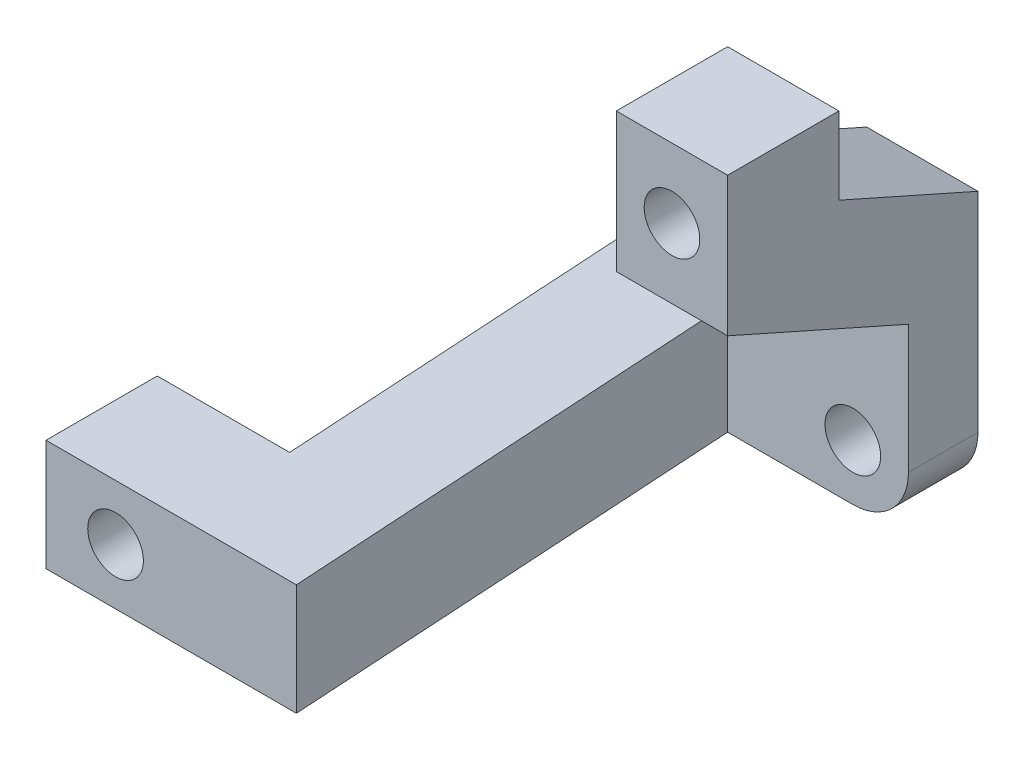
ISO-10303-21;
HEADER;
FILE_DESCRIPTION(('STEP AP214'),'2;1');
FILE_NAME('part.step','',(''),(''),'','','');
FILE_SCHEMA(('AUTOMOTIVE_DESIGN { 1 0 10303 214 1 1 1 1 }'));
ENDSEC;
DATA;
#1=APPLICATION_CONTEXT('core data for automotive mechanical design processes');
#2=APPLICATION_PROTOCOL_DEFINITION('international standard','automotive_design',2000,#1);
#3=PRODUCT_CONTEXT('',#1,'mechanical');
#4=PRODUCT('Part','Part','',(#3));
#5=PRODUCT_RELATED_PRODUCT_CATEGORY('part','',(#4));
#6=PRODUCT_DEFINITION_FORMATION('','',#4);
#7=PRODUCT_DEFINITION_CONTEXT('part definition',#1,'design');
#8=PRODUCT_DEFINITION('design','',#6,#7);
#9=PRODUCT_DEFINITION_SHAPE('','',#8);
#10=(LENGTH_UNIT() NAMED_UNIT(*) SI_UNIT(.MILLI.,.METRE.));
#11=(NAMED_UNIT(*) PLANE_ANGLE_UNIT() SI_UNIT($,.RADIAN.));
#12=(NAMED_UNIT(*) SI_UNIT($,.STERADIAN.) SOLID_ANGLE_UNIT());
#13=UNCERTAINTY_MEASURE_WITH_UNIT(LENGTH_MEASURE(1.E-05),#10,'distance_accuracy_value','');
#14=(GEOMETRIC_REPRESENTATION_CONTEXT(3) GLOBAL_UNCERTAINTY_ASSIGNED_CONTEXT((#13)) GLOBAL_UNIT_ASSIGNED_CONTEXT((#10,
#11,#12)) REPRESENTATION_CONTEXT('',''));
#15=CARTESIAN_POINT('',(0.,0.,0.));
#16=DIRECTION('',(0.,0.,1.));
#17=DIRECTION('',(1.,0.,0.));
#18=AXIS2_PLACEMENT_3D('',#15,#16,#17);
#19=CARTESIAN_POINT('',(0.,12.5257731958763,-5.56701030927835));
#20=DIRECTION('',(0.,-0.913811548620257,0.406138466053448));
#21=DIRECTION('',(0.,-0.406138466053448,-0.913811548620257));
#22=AXIS2_PLACEMENT_3D('',#19,#20,#21);
#23=PLANE('',#22);
#24=CARTESIAN_POINT('',(0.,20.,11.25));
#25=DIRECTION('',(0.,-0.913811548620257,0.406138466053448));
#26=DIRECTION('',(0.,-0.406138466053448,-0.913811548620257));
#27=AXIS2_PLACEMENT_3D('',#24,#25,#26);
#28=ELLIPSE('',#27,4.92442890089806,2.);
#29=CARTESIAN_POINT('',(1.92129071842118,19.4444444444444,10.));
#30=VERTEX_POINT('',#29);
#31=CARTESIAN_POINT('',(-1.92129071842118,19.4444444444444,10.));
#32=VERTEX_POINT('',#31);
#33=EDGE_CURVE('E72',#30,#32,#28,.F.);
#34=ORIENTED_EDGE('',*,*,#33,.F.);
#35=DIRECTION('',(-1.,0.,0.));
#36=VECTOR('',#35,1.);
#37=CARTESIAN_POINT('',(-4.,19.4444444444444,10.));
#38=LINE('',#37,#36);
#39=CARTESIAN_POINT('',(4.,19.4444444444444,10.));
#40=VERTEX_POINT('',#39);
#41=EDGE_CURVE('E78',#40,#30,#38,.T.);
#42=ORIENTED_EDGE('',*,*,#41,.F.);
#43=DIRECTION('',(0.,0.406138466053448,0.913811548620257));
#44=VECTOR('',#43,1.);
#45=CARTESIAN_POINT('',(4.,15.,0.));
#46=LINE('',#45,#44);
#47=CARTESIAN_POINT('',(4.,15.,0.));
#48=VERTEX_POINT('',#47);
#49=EDGE_CURVE('E232',#48,#40,#46,.T.);
#50=ORIENTED_EDGE('',*,*,#49,.F.);
#51=CARTESIAN_POINT('',(4.,15.,0.));
#52=DIRECTION('',(-1.,0.,0.));
#53=VECTOR('',#52,1.);
#54=LINE('',#51,#53);
#55=CARTESIAN_POINT('',(-4.,15.,0.));
#56=VERTEX_POINT('',#55);
#57=EDGE_CURVE('E227',#48,#56,#54,.T.);
#58=ORIENTED_EDGE('',*,*,#57,.T.);
#59=DIRECTION('',(0.,0.406138466053448,0.913811548620257));
#60=VECTOR('',#59,1.);
#61=CARTESIAN_POINT('',(-4.,15.,0.));
#62=LINE('',#61,#60);
#63=CARTESIAN_POINT('',(-4.,19.4444444444444,10.));
#64=VERTEX_POINT('',#63);
#65=EDGE_CURVE('E315',#56,#64,#62,.T.);
#66=ORIENTED_EDGE('',*,*,#65,.T.);
#67=EDGE_CURVE('E203',#32,#64,#38,.T.);
#68=ORIENTED_EDGE('',*,*,#67,.F.);
#69=EDGE_LOOP('',(#34,#42,#50,#58,#66,#68));
#70=FACE_BOUND('',#69,.T.);
#71=ADVANCED_FACE('F57',(#70),#23,.F.);
#72=CARTESIAN_POINT('',(0.,0.,5.));
#73=DIRECTION('',(0.,0.,1.));
#74=DIRECTION('',(1.,0.,0.));
#75=AXIS2_PLACEMENT_3D('',#72,#73,#74);
#76=PLANE('',#75);
#77=CARTESIAN_POINT('',(0.,0.,5.));
#78=DIRECTION('',(0.,0.,1.));
#79=DIRECTION('',(1.,0.,0.));
#80=AXIS2_PLACEMENT_3D('',#77,#78,#79);
#81=CIRCLE('',#80,2.);
#82=CARTESIAN_POINT('',(2.,0.,5.));
#83=VERTEX_POINT('',#82);
#84=EDGE_CURVE('E881',#83,#83,#81,.T.);
#85=ORIENTED_EDGE('',*,*,#84,.F.);
#86=EDGE_LOOP('',(#85));
#87=FACE_BOUND('',#86,.T.);
#88=DIRECTION('',(0.,-1.,0.));
#89=VECTOR('',#88,1.);
#90=CARTESIAN_POINT('',(4.,0.,5.));
#91=LINE('',#90,#89);
#92=CARTESIAN_POINT('',(4.,9.22222222222222,5.));
#93=VERTEX_POINT('',#92);
#94=CARTESIAN_POINT('',(4.,0.,5.));
#95=VERTEX_POINT('',#94);
#96=EDGE_CURVE('E460',#93,#95,#91,.T.);
#97=ORIENTED_EDGE('',*,*,#96,.F.);
#98=DIRECTION('',(-1.,0.,0.));
#99=VECTOR('',#98,1.);
#100=CARTESIAN_POINT('',(0.,9.22222222222222,5.));
#101=LINE('',#100,#99);
#102=CARTESIAN_POINT('',(-4.,9.22222222222222,5.));
#103=VERTEX_POINT('',#102);
#104=EDGE_CURVE('E276',#93,#103,#101,.T.);
#105=ORIENTED_EDGE('',*,*,#104,.T.);
#106=DIRECTION('',(0.,1.,0.));
#107=VECTOR('',#106,1.);
#108=CARTESIAN_POINT('',(-4.,0.,5.));
#109=LINE('',#108,#107);
#110=CARTESIAN_POINT('',(-4.,8.00000000000003,5.));
#111=VERTEX_POINT('',#110);
#112=EDGE_CURVE('E695',#111,#103,#109,.T.);
#113=ORIENTED_EDGE('',*,*,#112,.F.);
#114=CARTESIAN_POINT('',(-8.,8.,5.));
#115=DIRECTION('',(0.,0.,1.));
#116=DIRECTION('',(1.,0.,0.));
#117=AXIS2_PLACEMENT_3D('',#114,#115,#116);
#118=CIRCLE('',#117,4.);
#119=CARTESIAN_POINT('',(-8.00000000000003,4.,5.));
#120=VERTEX_POINT('',#119);
#121=EDGE_CURVE('E473',#111,#120,#118,.F.);
#122=ORIENTED_EDGE('',*,*,#121,.T.);
#123=DIRECTION('',(1.,0.,0.));
#124=VECTOR('',#123,1.);
#125=CARTESIAN_POINT('',(0.,4.,5.));
#126=LINE('',#125,#124);
#127=CARTESIAN_POINT('',(-9.00000000000001,4.,5.));
#128=VERTEX_POINT('',#127);
#129=EDGE_CURVE('E468',#128,#120,#126,.T.);
#130=ORIENTED_EDGE('',*,*,#129,.F.);
#131=DIRECTION('',(0.,1.,0.));
#132=VECTOR('',#131,1.);
#133=CARTESIAN_POINT('',(-9.00000000000001,4.,5.));
#134=LINE('',#133,#132);
#135=CARTESIAN_POINT('',(-9.00000000000001,-4.,5.));
#136=VERTEX_POINT('',#135);
#137=EDGE_CURVE('E494',#136,#128,#134,.T.);
#138=ORIENTED_EDGE('',*,*,#137,.F.);
#139=DIRECTION('',(1.,0.,0.));
#140=VECTOR('',#139,1.);
#141=CARTESIAN_POINT('',(0.,-4.,5.));
#142=LINE('',#141,#140);
#143=CARTESIAN_POINT('',(0.,-4.,5.));
#144=VERTEX_POINT('',#143);
#145=EDGE_CURVE('E474',#136,#144,#142,.T.);
#146=ORIENTED_EDGE('',*,*,#145,.T.);
#147=CARTESIAN_POINT('',(0.,0.,5.));
#148=DIRECTION('',(0.,0.,1.));
#149=DIRECTION('',(1.,0.,0.));
#150=AXIS2_PLACEMENT_3D('',#147,#148,#149);
#151=CIRCLE('',#150,4.);
#152=EDGE_CURVE('E620',#144,#95,#151,.T.);
#153=ORIENTED_EDGE('',*,*,#152,.T.);
#154=EDGE_LOOP('',(#97,#105,#113,#122,#130,#138,#146,#153));
#155=FACE_BOUND('',#154,.T.);
#156=ADVANCED_FACE('F243',(#87,#155),#76,.T.);
#157=CARTESIAN_POINT('',(-4.,0.,5.));
#158=DIRECTION('',(-1.,0.,0.));
#159=DIRECTION('',(0.,-1.,0.));
#160=AXIS2_PLACEMENT_3D('',#157,#158,#159);
#161=PLANE('',#160);
#162=DIRECTION('',(0.,1.,0.));
#163=VECTOR('',#162,1.);
#164=CARTESIAN_POINT('',(-4.,0.,0.));
#165=LINE('',#164,#163);
#166=CARTESIAN_POINT('',(-4.,8.00000000000003,0.));
#167=VERTEX_POINT('',#166);
#168=EDGE_CURVE('E428',#167,#56,#165,.T.);
#169=ORIENTED_EDGE('',*,*,#168,.F.);
#170=DIRECTION('',(0.,0.,-1.));
#171=VECTOR('',#170,1.);
#172=CARTESIAN_POINT('',(-4.,8.00000000000003,5.));
#173=LINE('',#172,#171);
#174=EDGE_CURVE('E66',#111,#167,#173,.T.);
#175=ORIENTED_EDGE('',*,*,#174,.F.);
#176=ORIENTED_EDGE('',*,*,#112,.T.);
#177=DIRECTION('',(0.,0.406138466053448,0.913811548620257));
#178=VECTOR('',#177,1.);
#179=CARTESIAN_POINT('',(-4.,7.,0.));
#180=LINE('',#179,#178);
#181=CARTESIAN_POINT('',(-4.,15.,18.));
#182=VERTEX_POINT('',#181);
#183=EDGE_CURVE('E307',#103,#182,#180,.T.);
#184=ORIENTED_EDGE('',*,*,#183,.T.);
#185=DIRECTION('',(0.,-1.,0.));
#186=VECTOR('',#185,1.);
#187=CARTESIAN_POINT('',(-4.,15.,18.));
#188=LINE('',#187,#186);
#189=CARTESIAN_POINT('',(-4.,23.,18.));
#190=VERTEX_POINT('',#189);
#191=EDGE_CURVE('E295',#190,#182,#188,.T.);
#192=ORIENTED_EDGE('',*,*,#191,.F.);
#193=DIRECTION('',(0.,1.,0.));
#194=VECTOR('',#193,1.);
#195=CARTESIAN_POINT('',(-4.,9.37497318287024,18.));
#196=LINE('',#195,#194);
#197=CARTESIAN_POINT('',(-4.,25.,18.));
#198=VERTEX_POINT('',#197);
#199=EDGE_CURVE('E216',#190,#198,#196,.T.);
#200=ORIENTED_EDGE('',*,*,#199,.T.);
#201=DIRECTION('',(0.,0.,1.));
#202=VECTOR('',#201,1.);
#203=CARTESIAN_POINT('',(-4.,25.,18.));
#204=LINE('',#203,#202);
#205=CARTESIAN_POINT('',(-4.,25.,10.));
#206=VERTEX_POINT('',#205);
#207=EDGE_CURVE('E219',#206,#198,#204,.T.);
#208=ORIENTED_EDGE('',*,*,#207,.F.);
#209=DIRECTION('',(0.,1.,0.));
#210=VECTOR('',#209,1.);
#211=CARTESIAN_POINT('',(-4.,9.37497318287024,10.));
#212=LINE('',#211,#210);
#213=EDGE_CURVE('E212',#64,#206,#212,.T.);
#214=ORIENTED_EDGE('',*,*,#213,.F.);
#215=ORIENTED_EDGE('',*,*,#65,.F.);
#216=EDGE_LOOP('',(#169,#175,#176,#184,#192,#200,#208,#214,#215));
#217=FACE_BOUND('',#216,.T.);
#218=ADVANCED_FACE('F402',(#217),#161,.T.);
#219=CARTESIAN_POINT('',(-8.,8.,5.));
#220=DIRECTION('',(0.,0.,-1.));
#221=DIRECTION('',(-1.,0.,0.));
#222=AXIS2_PLACEMENT_3D('',#219,#220,#221);
#223=CYLINDRICAL_SURFACE('',#222,4.);
#224=CARTESIAN_POINT('',(-8.,8.,0.));
#225=DIRECTION('',(0.,0.,1.));
#226=DIRECTION('',(1.,0.,0.));
#227=AXIS2_PLACEMENT_3D('',#224,#225,#226);
#228=CIRCLE('',#227,4.);
#229=CARTESIAN_POINT('',(-8.00000000000003,4.,0.));
#230=VERTEX_POINT('',#229);
#231=EDGE_CURVE('E431',#167,#230,#228,.F.);
#232=ORIENTED_EDGE('',*,*,#231,.T.);
#233=DIRECTION('',(0.,0.,-1.));
#234=VECTOR('',#233,1.);
#235=CARTESIAN_POINT('',(-8.00000000000003,4.,5.));
#236=LINE('',#235,#234);
#237=EDGE_CURVE('E443',#120,#230,#236,.T.);
#238=ORIENTED_EDGE('',*,*,#237,.F.);
#239=ORIENTED_EDGE('',*,*,#121,.F.);
#240=ORIENTED_EDGE('',*,*,#174,.T.);
#241=EDGE_LOOP('',(#232,#238,#239,#240));
#242=FACE_BOUND('',#241,.T.);
#243=ADVANCED_FACE('F400',(#242),#223,.F.);
#244=CARTESIAN_POINT('',(0.,4.,5.));
#245=DIRECTION('',(0.,1.,0.));
#246=DIRECTION('',(-1.,0.,0.));
#247=AXIS2_PLACEMENT_3D('',#244,#245,#246);
#248=PLANE('',#247);
#249=DIRECTION('',(1.,0.,0.));
#250=VECTOR('',#249,1.);
#251=CARTESIAN_POINT('',(0.,4.,0.));
#252=LINE('',#251,#250);
#253=CARTESIAN_POINT('',(-15.,4.,0.));
#254=VERTEX_POINT('',#253);
#255=EDGE_CURVE('E438',#254,#230,#252,.T.);
#256=ORIENTED_EDGE('',*,*,#255,.F.);
#257=DIRECTION('',(0.,0.,-1.));
#258=VECTOR('',#257,1.);
#259=CARTESIAN_POINT('',(-15.,4.,5.));
#260=LINE('',#259,#258);
#261=CARTESIAN_POINT('',(-15.,4.,5.));
#262=VERTEX_POINT('',#261);
#263=EDGE_CURVE('E467',#262,#254,#260,.T.);
#264=ORIENTED_EDGE('',*,*,#263,.F.);
#265=DIRECTION('',(-1.,0.,0.));
#266=VECTOR('',#265,1.);
#267=CARTESIAN_POINT('',(-17.,4.,5.));
#268=LINE('',#267,#266);
#269=CARTESIAN_POINT('',(-17.,4.,5.));
#270=VERTEX_POINT('',#269);
#271=EDGE_CURVE('E496',#262,#270,#268,.T.);
#272=ORIENTED_EDGE('',*,*,#271,.T.);
#273=DIRECTION('',(0.0604950604018905,0.,0.998168496631191));
#274=VECTOR('',#273,1.);
#275=CARTESIAN_POINT('',(-17.,4.,5.));
#276=LINE('',#275,#274);
#277=CARTESIAN_POINT('',(-15.4848484848485,4.,30.));
#278=VERTEX_POINT('',#277);
#279=EDGE_CURVE('E586',#270,#278,#276,.T.);
#280=ORIENTED_EDGE('',*,*,#279,.T.);
#281=DIRECTION('',(-1.,0.,0.));
#282=VECTOR('',#281,1.);
#283=CARTESIAN_POINT('',(-3.91833618562959,4.,30.));
#284=LINE('',#283,#282);
#285=CARTESIAN_POINT('',(-25.,4.,30.));
#286=VERTEX_POINT('',#285);
#287=EDGE_CURVE('E664',#278,#286,#284,.T.);
#288=ORIENTED_EDGE('',*,*,#287,.T.);
#289=DIRECTION('',(0.,0.,1.));
#290=VECTOR('',#289,1.);
#291=CARTESIAN_POINT('',(-25.,4.,30.));
#292=LINE('',#291,#290);
#293=CARTESIAN_POINT('',(-25.,4.,38.));
#294=VERTEX_POINT('',#293);
#295=EDGE_CURVE('E661',#286,#294,#292,.T.);
#296=ORIENTED_EDGE('',*,*,#295,.T.);
#297=DIRECTION('',(-1.,0.,0.));
#298=VECTOR('',#297,1.);
#299=CARTESIAN_POINT('',(-3.91833618562959,4.,38.));
#300=LINE('',#299,#298);
#301=CARTESIAN_POINT('',(-15.,4.,38.));
#302=VERTEX_POINT('',#301);
#303=EDGE_CURVE('E529',#302,#294,#300,.T.);
#304=ORIENTED_EDGE('',*,*,#303,.F.);
#305=DIRECTION('',(-1.,0.,0.));
#306=VECTOR('',#305,1.);
#307=CARTESIAN_POINT('',(-15.,4.,38.));
#308=LINE('',#307,#306);
#309=CARTESIAN_POINT('',(-7.00000000000001,4.,38.));
#310=VERTEX_POINT('',#309);
#311=EDGE_CURVE('E384',#310,#302,#308,.T.);
#312=ORIENTED_EDGE('',*,*,#311,.F.);
#313=DIRECTION('',(0.0604950604018904,0.,0.998168496631191));
#314=VECTOR('',#313,1.);
#315=CARTESIAN_POINT('',(-9.00000000000001,4.,5.));
#316=LINE('',#315,#314);
#317=EDGE_CURVE('E579',#128,#310,#316,.T.);
#318=ORIENTED_EDGE('',*,*,#317,.F.);
#319=ORIENTED_EDGE('',*,*,#129,.T.);
#320=ORIENTED_EDGE('',*,*,#237,.T.);
#321=EDGE_LOOP('',(#256,#264,#272,#280,#288,#296,#304,#312,#318,#319,#320));
#322=FACE_BOUND('',#321,.T.);
#323=ADVANCED_FACE('F391',(#322),#248,.T.);
#324=CARTESIAN_POINT('',(-15.,0.,5.));
#325=DIRECTION('',(-1.,0.,0.));
#326=DIRECTION('',(0.,0.,1.));
#327=AXIS2_PLACEMENT_3D('',#324,#325,#326);
#328=PLANE('',#327);
#329=DIRECTION('',(0.,1.,0.));
#330=VECTOR('',#329,1.);
#331=CARTESIAN_POINT('',(-15.,0.,0.));
#332=LINE('',#331,#330);
#333=CARTESIAN_POINT('',(-15.,-4.,0.));
#334=VERTEX_POINT('',#333);
#335=EDGE_CURVE('E632',#334,#254,#332,.T.);
#336=ORIENTED_EDGE('',*,*,#335,.F.);
#337=DIRECTION('',(0.,0.,-1.));
#338=VECTOR('',#337,1.);
#339=CARTESIAN_POINT('',(-15.,-4.,5.));
#340=LINE('',#339,#338);
#341=CARTESIAN_POINT('',(-15.,-4.,5.));
#342=VERTEX_POINT('',#341);
#343=EDGE_CURVE('E464',#342,#334,#340,.T.);
#344=ORIENTED_EDGE('',*,*,#343,.F.);
#345=DIRECTION('',(0.,1.,0.));
#346=VECTOR('',#345,1.);
#347=CARTESIAN_POINT('',(-15.,0.,5.));
#348=LINE('',#347,#346);
#349=EDGE_CURVE('E472',#342,#262,#348,.T.);
#350=ORIENTED_EDGE('',*,*,#349,.T.);
#351=ORIENTED_EDGE('',*,*,#263,.T.);
#352=EDGE_LOOP('',(#336,#344,#350,#351));
#353=FACE_BOUND('',#352,.T.);
#354=ADVANCED_FACE('F364',(#353),#328,.T.);
#355=CARTESIAN_POINT('',(0.,-4.,5.));
#356=DIRECTION('',(0.,1.,0.));
#357=DIRECTION('',(-1.,0.,0.));
#358=AXIS2_PLACEMENT_3D('',#355,#356,#357);
#359=PLANE('',#358);
#360=DIRECTION('',(1.,0.,0.));
#361=VECTOR('',#360,1.);
#362=CARTESIAN_POINT('',(0.,-4.,0.));
#363=LINE('',#362,#361);
#364=CARTESIAN_POINT('',(0.,-4.,0.));
#365=VERTEX_POINT('',#364);
#366=EDGE_CURVE('E635',#334,#365,#363,.T.);
#367=ORIENTED_EDGE('',*,*,#366,.T.);
#368=DIRECTION('',(0.,0.,-1.));
#369=VECTOR('',#368,1.);
#370=CARTESIAN_POINT('',(0.,-4.,5.));
#371=LINE('',#370,#369);
#372=EDGE_CURVE('E459',#144,#365,#371,.T.);
#373=ORIENTED_EDGE('',*,*,#372,.F.);
#374=ORIENTED_EDGE('',*,*,#145,.F.);
#375=DIRECTION('',(0.0604950604018904,0.,0.998168496631191));
#376=VECTOR('',#375,1.);
#377=CARTESIAN_POINT('',(-9.00000000000001,-4.,5.));
#378=LINE('',#377,#376);
#379=CARTESIAN_POINT('',(-7.,-4.,38.));
#380=VERTEX_POINT('',#379);
#381=EDGE_CURVE('E581',#136,#380,#378,.T.);
#382=ORIENTED_EDGE('',*,*,#381,.T.);
#383=DIRECTION('',(1.,0.,0.));
#384=VECTOR('',#383,1.);
#385=CARTESIAN_POINT('',(-7.,-4.,38.));
#386=LINE('',#385,#384);
#387=CARTESIAN_POINT('',(-15.,-4.,38.));
#388=VERTEX_POINT('',#387);
#389=EDGE_CURVE('E524',#388,#380,#386,.T.);
#390=ORIENTED_EDGE('',*,*,#389,.F.);
#391=DIRECTION('',(-1.,0.,0.));
#392=VECTOR('',#391,1.);
#393=CARTESIAN_POINT('',(-3.91833618562959,-4.,38.));
#394=LINE('',#393,#392);
#395=CARTESIAN_POINT('',(-25.,-4.,38.));
#396=VERTEX_POINT('',#395);
#397=EDGE_CURVE('E517',#388,#396,#394,.T.);
#398=ORIENTED_EDGE('',*,*,#397,.T.);
#399=DIRECTION('',(0.,0.,-1.));
#400=VECTOR('',#399,1.);
#401=CARTESIAN_POINT('',(-25.,-4.,30.));
#402=LINE('',#401,#400);
#403=CARTESIAN_POINT('',(-25.,-4.,30.));
#404=VERTEX_POINT('',#403);
#405=EDGE_CURVE('E520',#396,#404,#402,.T.);
#406=ORIENTED_EDGE('',*,*,#405,.T.);
#407=DIRECTION('',(-1.,0.,0.));
#408=VECTOR('',#407,1.);
#409=CARTESIAN_POINT('',(-3.91833618562959,-4.,30.));
#410=LINE('',#409,#408);
#411=CARTESIAN_POINT('',(-15.4848484848485,-4.,30.));
#412=VERTEX_POINT('',#411);
#413=EDGE_CURVE('E590',#412,#404,#410,.T.);
#414=ORIENTED_EDGE('',*,*,#413,.F.);
#415=DIRECTION('',(0.0604950604018905,0.,0.998168496631191));
#416=VECTOR('',#415,1.);
#417=CARTESIAN_POINT('',(-17.,-4.,5.));
#418=LINE('',#417,#416);
#419=CARTESIAN_POINT('',(-17.,-4.,5.));
#420=VERTEX_POINT('',#419);
#421=EDGE_CURVE('E503',#420,#412,#418,.T.);
#422=ORIENTED_EDGE('',*,*,#421,.F.);
#423=DIRECTION('',(1.,0.,0.));
#424=VECTOR('',#423,1.);
#425=CARTESIAN_POINT('',(-17.,-4.,5.));
#426=LINE('',#425,#424);
#427=EDGE_CURVE('E497',#420,#342,#426,.T.);
#428=ORIENTED_EDGE('',*,*,#427,.T.);
#429=ORIENTED_EDGE('',*,*,#343,.T.);
#430=EDGE_LOOP('',(#367,#373,#374,#382,#390,#398,#406,#414,#422,#428,#429));
#431=FACE_BOUND('',#430,.T.);
#432=ADVANCED_FACE('F359',(#431),#359,.F.);
#433=CARTESIAN_POINT('',(0.,0.,5.));
#434=DIRECTION('',(0.,0.,-1.));
#435=DIRECTION('',(-1.,0.,0.));
#436=AXIS2_PLACEMENT_3D('',#433,#434,#435);
#437=CYLINDRICAL_SURFACE('',#436,4.);
#438=CARTESIAN_POINT('',(0.,0.,0.));
#439=DIRECTION('',(0.,0.,1.));
#440=DIRECTION('',(1.,0.,0.));
#441=AXIS2_PLACEMENT_3D('',#438,#439,#440);
#442=CIRCLE('',#441,4.);
#443=CARTESIAN_POINT('',(4.,0.,0.));
#444=VERTEX_POINT('',#443);
#445=EDGE_CURVE('E448',#365,#444,#442,.T.);
#446=ORIENTED_EDGE('',*,*,#445,.T.);
#447=DIRECTION('',(0.,0.,-1.));
#448=VECTOR('',#447,1.);
#449=CARTESIAN_POINT('',(4.,0.,5.));
#450=LINE('',#449,#448);
#451=EDGE_CURVE('E455',#95,#444,#450,.T.);
#452=ORIENTED_EDGE('',*,*,#451,.F.);
#453=ORIENTED_EDGE('',*,*,#152,.F.);
#454=ORIENTED_EDGE('',*,*,#372,.T.);
#455=EDGE_LOOP('',(#446,#452,#453,#454));
#456=FACE_BOUND('',#455,.T.);
#457=ADVANCED_FACE('F352',(#456),#437,.T.);
#458=CARTESIAN_POINT('',(4.,0.,5.));
#459=DIRECTION('',(1.,0.,0.));
#460=DIRECTION('',(0.,1.,0.));
#461=AXIS2_PLACEMENT_3D('',#458,#459,#460);
#462=PLANE('',#461);
#463=DIRECTION('',(0.,0.406138466053448,0.913811548620257));
#464=VECTOR('',#463,1.);
#465=CARTESIAN_POINT('',(4.,7.,0.));
#466=LINE('',#465,#464);
#467=CARTESIAN_POINT('',(4.,15.,18.));
#468=VERTEX_POINT('',#467);
#469=EDGE_CURVE('E299',#93,#468,#466,.T.);
#470=ORIENTED_EDGE('',*,*,#469,.F.);
#471=ORIENTED_EDGE('',*,*,#96,.T.);
#472=ORIENTED_EDGE('',*,*,#451,.T.);
#473=DIRECTION('',(0.,-1.,0.));
#474=VECTOR('',#473,1.);
#475=CARTESIAN_POINT('',(4.,0.,0.));
#476=LINE('',#475,#474);
#477=EDGE_CURVE('E444',#48,#444,#476,.T.);
#478=ORIENTED_EDGE('',*,*,#477,.F.);
#479=ORIENTED_EDGE('',*,*,#49,.T.);
#480=DIRECTION('',(0.,1.,0.));
#481=VECTOR('',#480,1.);
#482=CARTESIAN_POINT('',(4.,9.37497318287024,10.));
#483=LINE('',#482,#481);
#484=CARTESIAN_POINT('',(4.,25.,10.));
#485=VERTEX_POINT('',#484);
#486=EDGE_CURVE('E210',#40,#485,#483,.T.);
#487=ORIENTED_EDGE('',*,*,#486,.T.);
#488=DIRECTION('',(0.,0.,-1.));
#489=VECTOR('',#488,1.);
#490=CARTESIAN_POINT('',(4.,25.,18.));
#491=LINE('',#490,#489);
#492=CARTESIAN_POINT('',(4.,25.,18.));
#493=VERTEX_POINT('',#492);
#494=EDGE_CURVE('E701',#493,#485,#491,.T.);
#495=ORIENTED_EDGE('',*,*,#494,.F.);
#496=DIRECTION('',(0.,1.,0.));
#497=VECTOR('',#496,1.);
#498=CARTESIAN_POINT('',(4.,9.37497318287024,18.));
#499=LINE('',#498,#497);
#500=CARTESIAN_POINT('',(4.,23.,18.));
#501=VERTEX_POINT('',#500);
#502=EDGE_CURVE('E224',#501,#493,#499,.T.);
#503=ORIENTED_EDGE('',*,*,#502,.F.);
#504=DIRECTION('',(0.,1.,0.));
#505=VECTOR('',#504,1.);
#506=CARTESIAN_POINT('',(4.,15.,18.));
#507=LINE('',#506,#505);
#508=EDGE_CURVE('E277',#468,#501,#507,.T.);
#509=ORIENTED_EDGE('',*,*,#508,.F.);
#510=EDGE_LOOP('',(#470,#471,#472,#478,#479,#487,#495,#503,#509));
#511=FACE_BOUND('',#510,.T.);
#512=ADVANCED_FACE('F342',(#511),#462,.T.);
#513=CARTESIAN_POINT('',(0.,0.,5.));
#514=DIRECTION('',(0.,0.,-1.));
#515=DIRECTION('',(-1.,0.,0.));
#516=AXIS2_PLACEMENT_3D('',#513,#514,#515);
#517=CYLINDRICAL_SURFACE('',#516,2.);
#518=ORIENTED_EDGE('',*,*,#84,.T.);
#519=EDGE_LOOP('',(#518));
#520=FACE_BOUND('',#519,.T.);
#521=CARTESIAN_POINT('',(0.,0.,0.));
#522=DIRECTION('',(0.,0.,1.));
#523=DIRECTION('',(1.,0.,0.));
#524=AXIS2_PLACEMENT_3D('',#521,#522,#523);
#525=CIRCLE('',#524,2.);
#526=CARTESIAN_POINT('',(2.,0.,0.));
#527=VERTEX_POINT('',#526);
#528=EDGE_CURVE('E432',#527,#527,#525,.T.);
#529=ORIENTED_EDGE('',*,*,#528,.F.);
#530=EDGE_LOOP('',(#529));
#531=FACE_BOUND('',#530,.T.);
#532=ADVANCED_FACE('F59',(#520,#531),#517,.F.);
#533=CARTESIAN_POINT('',(0.,0.,0.));
#534=DIRECTION('',(0.,0.,1.));
#535=DIRECTION('',(1.,0.,0.));
#536=AXIS2_PLACEMENT_3D('',#533,#534,#535);
#537=PLANE('',#536);
#538=ORIENTED_EDGE('',*,*,#231,.F.);
#539=ORIENTED_EDGE('',*,*,#168,.T.);
#540=ORIENTED_EDGE('',*,*,#57,.F.);
#541=ORIENTED_EDGE('',*,*,#477,.T.);
#542=ORIENTED_EDGE('',*,*,#445,.F.);
#543=ORIENTED_EDGE('',*,*,#366,.F.);
#544=ORIENTED_EDGE('',*,*,#335,.T.);
#545=ORIENTED_EDGE('',*,*,#255,.T.);
#546=EDGE_LOOP('',(#538,#539,#540,#541,#542,#543,#544,#545));
#547=FACE_BOUND('',#546,.T.);
#548=ORIENTED_EDGE('',*,*,#528,.T.);
#549=EDGE_LOOP('',(#548));
#550=FACE_BOUND('',#549,.T.);
#551=ADVANCED_FACE('F354',(#547,#550),#537,.F.);
#552=CARTESIAN_POINT('',(0.,0.,38.));
#553=DIRECTION('',(0.,0.,-1.));
#554=DIRECTION('',(-1.,0.,0.));
#555=AXIS2_PLACEMENT_3D('',#552,#553,#554);
#556=PLANE('',#555);
#557=CARTESIAN_POINT('',(-20.,0.,38.));
#558=DIRECTION('',(0.,0.,-1.));
#559=DIRECTION('',(-1.,0.,0.));
#560=AXIS2_PLACEMENT_3D('',#557,#558,#559);
#561=CIRCLE('',#560,2.);
#562=CARTESIAN_POINT('',(-22.,0.,38.));
#563=VERTEX_POINT('',#562);
#564=EDGE_CURVE('E651',#563,#563,#561,.F.);
#565=ORIENTED_EDGE('',*,*,#564,.F.);
#566=EDGE_LOOP('',(#565));
#567=FACE_BOUND('',#566,.T.);
#568=ORIENTED_EDGE('',*,*,#311,.T.);
#569=ORIENTED_EDGE('',*,*,#303,.T.);
#570=DIRECTION('',(0.,-1.,0.));
#571=VECTOR('',#570,1.);
#572=CARTESIAN_POINT('',(-25.,4.,38.));
#573=LINE('',#572,#571);
#574=EDGE_CURVE('E521',#294,#396,#573,.T.);
#575=ORIENTED_EDGE('',*,*,#574,.T.);
#576=ORIENTED_EDGE('',*,*,#397,.F.);
#577=ORIENTED_EDGE('',*,*,#389,.T.);
#578=DIRECTION('',(0.,1.,0.));
#579=VECTOR('',#578,1.);
#580=CARTESIAN_POINT('',(-7.00000000000001,4.,38.));
#581=LINE('',#580,#579);
#582=EDGE_CURVE('E528',#380,#310,#581,.T.);
#583=ORIENTED_EDGE('',*,*,#582,.T.);
#584=EDGE_LOOP('',(#568,#569,#575,#576,#577,#583));
#585=FACE_BOUND('',#584,.T.);
#586=ADVANCED_FACE('F545',(#567,#585),#556,.F.);
#587=CARTESIAN_POINT('',(0.,0.,5.));
#588=DIRECTION('',(0.,0.,1.));
#589=DIRECTION('',(1.,0.,0.));
#590=AXIS2_PLACEMENT_3D('',#587,#588,#589);
#591=PLANE('',#590);
#592=ORIENTED_EDGE('',*,*,#349,.F.);
#593=ORIENTED_EDGE('',*,*,#427,.F.);
#594=DIRECTION('',(0.,-1.,0.));
#595=VECTOR('',#594,1.);
#596=CARTESIAN_POINT('',(-17.,4.,5.));
#597=LINE('',#596,#595);
#598=EDGE_CURVE('E389',#270,#420,#597,.T.);
#599=ORIENTED_EDGE('',*,*,#598,.F.);
#600=ORIENTED_EDGE('',*,*,#271,.F.);
#601=EDGE_LOOP('',(#592,#593,#599,#600));
#602=FACE_BOUND('',#601,.T.);
#603=ADVANCED_FACE('F554',(#602),#591,.F.);
#604=CARTESIAN_POINT('',(-17.2397072278134,0.,1.0448307410796));
#605=DIRECTION('',(0.998168496631191,0.,-0.0604950604018905));
#606=DIRECTION('',(-0.0604950604018905,0.,-0.998168496631191));
#607=AXIS2_PLACEMENT_3D('',#604,#605,#606);
#608=PLANE('',#607);
#609=ORIENTED_EDGE('',*,*,#421,.T.);
#610=DIRECTION('',(0.,1.,0.));
#611=VECTOR('',#610,1.);
#612=CARTESIAN_POINT('',(-15.4848484848485,4.,30.));
#613=LINE('',#612,#611);
#614=EDGE_CURVE('E511',#412,#278,#613,.T.);
#615=ORIENTED_EDGE('',*,*,#614,.T.);
#616=ORIENTED_EDGE('',*,*,#279,.F.);
#617=ORIENTED_EDGE('',*,*,#598,.T.);
#618=EDGE_LOOP('',(#609,#615,#616,#617));
#619=FACE_BOUND('',#618,.T.);
#620=ADVANCED_FACE('F685',(#619),#608,.F.);
#621=CARTESIAN_POINT('',(-9.26898444647759,0.,0.561756633119854));
#622=DIRECTION('',(-0.998168496631191,0.,0.0604950604018904));
#623=DIRECTION('',(0.0604950604018904,0.,0.998168496631191));
#624=AXIS2_PLACEMENT_3D('',#621,#622,#623);
#625=PLANE('',#624);
#626=ORIENTED_EDGE('',*,*,#317,.T.);
#627=ORIENTED_EDGE('',*,*,#582,.F.);
#628=ORIENTED_EDGE('',*,*,#381,.F.);
#629=ORIENTED_EDGE('',*,*,#137,.T.);
#630=EDGE_LOOP('',(#626,#627,#628,#629));
#631=FACE_BOUND('',#630,.T.);
#632=ADVANCED_FACE('F556',(#631),#625,.F.);
#633=CARTESIAN_POINT('',(-3.91833618562959,4.,30.));
#634=DIRECTION('',(0.,0.,1.));
#635=DIRECTION('',(1.,0.,0.));
#636=AXIS2_PLACEMENT_3D('',#633,#634,#635);
#637=PLANE('',#636);
#638=CARTESIAN_POINT('',(-20.,0.,30.));
#639=DIRECTION('',(0.,0.,1.));
#640=DIRECTION('',(1.,0.,0.));
#641=AXIS2_PLACEMENT_3D('',#638,#639,#640);
#642=CIRCLE('',#641,2.);
#643=CARTESIAN_POINT('',(-18.,0.,30.));
#644=VERTEX_POINT('',#643);
#645=EDGE_CURVE('E449',#644,#644,#642,.F.);
#646=ORIENTED_EDGE('',*,*,#645,.F.);
#647=EDGE_LOOP('',(#646));
#648=FACE_BOUND('',#647,.T.);
#649=ORIENTED_EDGE('',*,*,#614,.F.);
#650=ORIENTED_EDGE('',*,*,#413,.T.);
#651=DIRECTION('',(0.,1.,0.));
#652=VECTOR('',#651,1.);
#653=CARTESIAN_POINT('',(-25.,4.,30.));
#654=LINE('',#653,#652);
#655=EDGE_CURVE('E665',#404,#286,#654,.T.);
#656=ORIENTED_EDGE('',*,*,#655,.T.);
#657=ORIENTED_EDGE('',*,*,#287,.F.);
#658=EDGE_LOOP('',(#649,#650,#656,#657));
#659=FACE_BOUND('',#658,.T.);
#660=ADVANCED_FACE('F682',(#648,#659),#637,.F.);
#661=CARTESIAN_POINT('',(-25.,0.,0.));
#662=DIRECTION('',(-1.,0.,0.));
#663=DIRECTION('',(0.,0.,1.));
#664=AXIS2_PLACEMENT_3D('',#661,#662,#663);
#665=PLANE('',#664);
#666=ORIENTED_EDGE('',*,*,#655,.F.);
#667=ORIENTED_EDGE('',*,*,#405,.F.);
#668=ORIENTED_EDGE('',*,*,#574,.F.);
#669=ORIENTED_EDGE('',*,*,#295,.F.);
#670=EDGE_LOOP('',(#666,#667,#668,#669));
#671=FACE_BOUND('',#670,.T.);
#672=ADVANCED_FACE('F680',(#671),#665,.T.);
#673=CARTESIAN_POINT('',(-20.,0.,99.));
#674=DIRECTION('',(0.,0.,-1.));
#675=DIRECTION('',(-1.,0.,0.));
#676=AXIS2_PLACEMENT_3D('',#673,#674,#675);
#677=CYLINDRICAL_SURFACE('',#676,2.);
#678=ORIENTED_EDGE('',*,*,#645,.T.);
#679=EDGE_LOOP('',(#678));
#680=FACE_BOUND('',#679,.T.);
#681=ORIENTED_EDGE('',*,*,#564,.T.);
#682=EDGE_LOOP('',(#681));
#683=FACE_BOUND('',#682,.T.);
#684=ADVANCED_FACE('F715',(#680,#683),#677,.F.);
#685=CARTESIAN_POINT('',(0.,0.,18.));
#686=DIRECTION('',(0.,0.,-1.));
#687=DIRECTION('',(-1.,0.,0.));
#688=AXIS2_PLACEMENT_3D('',#685,#686,#687);
#689=PLANE('',#688);
#690=CARTESIAN_POINT('',(0.,20.,18.));
#691=DIRECTION('',(0.,0.,-1.));
#692=DIRECTION('',(-1.,0.,0.));
#693=AXIS2_PLACEMENT_3D('',#690,#691,#692);
#694=CIRCLE('',#693,2.);
#695=CARTESIAN_POINT('',(-2.,20.,18.));
#696=VERTEX_POINT('',#695);
#697=EDGE_CURVE('E205',#696,#696,#694,.F.);
#698=ORIENTED_EDGE('',*,*,#697,.F.);
#699=EDGE_LOOP('',(#698));
#700=FACE_BOUND('',#699,.T.);
#701=ORIENTED_EDGE('',*,*,#191,.T.);
#702=DIRECTION('',(1.,0.,0.));
#703=VECTOR('',#702,1.);
#704=CARTESIAN_POINT('',(-4.,15.,18.));
#705=LINE('',#704,#703);
#706=EDGE_CURVE('E271',#182,#468,#705,.T.);
#707=ORIENTED_EDGE('',*,*,#706,.T.);
#708=ORIENTED_EDGE('',*,*,#508,.T.);
#709=ORIENTED_EDGE('',*,*,#502,.T.);
#710=DIRECTION('',(1.,0.,0.));
#711=VECTOR('',#710,1.);
#712=CARTESIAN_POINT('',(-4.,25.,18.));
#713=LINE('',#712,#711);
#714=EDGE_CURVE('E704',#198,#493,#713,.T.);
#715=ORIENTED_EDGE('',*,*,#714,.F.);
#716=ORIENTED_EDGE('',*,*,#199,.F.);
#717=EDGE_LOOP('',(#701,#707,#708,#709,#715,#716));
#718=FACE_BOUND('',#717,.T.);
#719=ADVANCED_FACE('F250',(#700,#718),#689,.F.);
#720=CARTESIAN_POINT('',(0.,5.84536082474227,-2.5979381443299));
#721=DIRECTION('',(0.,0.913811548620257,-0.406138466053448));
#722=DIRECTION('',(0.,0.406138466053448,0.913811548620257));
#723=AXIS2_PLACEMENT_3D('',#720,#721,#722);
#724=PLANE('',#723);
#725=ORIENTED_EDGE('',*,*,#104,.F.);
#726=ORIENTED_EDGE('',*,*,#469,.T.);
#727=ORIENTED_EDGE('',*,*,#706,.F.);
#728=ORIENTED_EDGE('',*,*,#183,.F.);
#729=EDGE_LOOP('',(#725,#726,#727,#728));
#730=FACE_BOUND('',#729,.T.);
#731=ADVANCED_FACE('F245',(#730),#724,.F.);
#732=CARTESIAN_POINT('',(0.,25.,0.));
#733=DIRECTION('',(0.,-1.,0.));
#734=DIRECTION('',(0.,0.,-1.));
#735=AXIS2_PLACEMENT_3D('',#732,#733,#734);
#736=PLANE('',#735);
#737=ORIENTED_EDGE('',*,*,#207,.T.);
#738=ORIENTED_EDGE('',*,*,#714,.T.);
#739=ORIENTED_EDGE('',*,*,#494,.T.);
#740=DIRECTION('',(-1.,0.,0.));
#741=VECTOR('',#740,1.);
#742=CARTESIAN_POINT('',(-4.,25.,10.));
#743=LINE('',#742,#741);
#744=EDGE_CURVE('E334',#485,#206,#743,.T.);
#745=ORIENTED_EDGE('',*,*,#744,.T.);
#746=EDGE_LOOP('',(#737,#738,#739,#745));
#747=FACE_BOUND('',#746,.T.);
#748=ADVANCED_FACE('F249',(#747),#736,.F.);
#749=CARTESIAN_POINT('',(-4.,9.37497318287024,10.));
#750=DIRECTION('',(0.,0.,-1.));
#751=DIRECTION('',(-1.,0.,0.));
#752=AXIS2_PLACEMENT_3D('',#749,#750,#751);
#753=PLANE('',#752);
#754=ORIENTED_EDGE('',*,*,#41,.T.);
#755=CARTESIAN_POINT('',(0.,20.,10.));
#756=DIRECTION('',(0.,0.,-1.));
#757=DIRECTION('',(-1.,0.,0.));
#758=AXIS2_PLACEMENT_3D('',#755,#756,#757);
#759=CIRCLE('',#758,2.);
#760=EDGE_CURVE('E12',#30,#32,#759,.F.);
#761=ORIENTED_EDGE('',*,*,#760,.T.);
#762=ORIENTED_EDGE('',*,*,#67,.T.);
#763=ORIENTED_EDGE('',*,*,#213,.T.);
#764=ORIENTED_EDGE('',*,*,#744,.F.);
#765=ORIENTED_EDGE('',*,*,#486,.F.);
#766=EDGE_LOOP('',(#754,#761,#762,#763,#764,#765));
#767=FACE_BOUND('',#766,.T.);
#768=ADVANCED_FACE('F208',(#767),#753,.T.);
#769=CARTESIAN_POINT('',(0.,20.,33.5));
#770=DIRECTION('',(0.,0.,-1.));
#771=DIRECTION('',(-1.,0.,0.));
#772=AXIS2_PLACEMENT_3D('',#769,#770,#771);
#773=CYLINDRICAL_SURFACE('',#772,2.);
#774=ORIENTED_EDGE('',*,*,#33,.T.);
#775=ORIENTED_EDGE('',*,*,#760,.F.);
#776=EDGE_LOOP('',(#774,#775));
#777=FACE_BOUND('',#776,.T.);
#778=ORIENTED_EDGE('',*,*,#697,.T.);
#779=EDGE_LOOP('',(#778));
#780=FACE_BOUND('',#779,.T.);
#781=ADVANCED_FACE('F198',(#777,#780),#773,.F.);
#782=CLOSED_SHELL('',(#71,#156,#218,#243,#323,#354,#432,#457,#512,#532,#551,#586,#603,#620,#632,
#660,#672,#684,#719,#731,#748,#768,#781));
#783=MANIFOLD_SOLID_BREP('B2',#782);
#784=ADVANCED_BREP_SHAPE_REPRESENTATION('',(#18,#783),#14);
#785=SHAPE_DEFINITION_REPRESENTATION(#9,#784);
ENDSEC;
END-ISO-10303-21;
